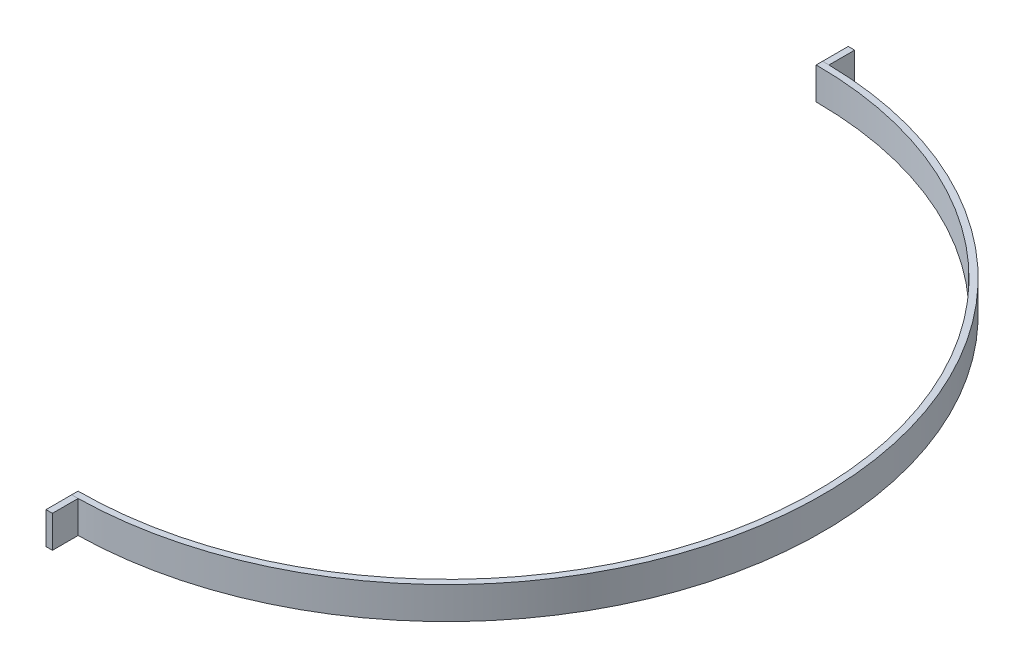
ISO-10303-21;
HEADER;
FILE_DESCRIPTION(('STEP AP214'),'2;1');
FILE_NAME('part.step','',(''),(''),'','','');
FILE_SCHEMA(('AUTOMOTIVE_DESIGN { 1 0 10303 214 1 1 1 1 }'));
ENDSEC;
DATA;
#1=APPLICATION_CONTEXT('core data for automotive mechanical design processes');
#2=APPLICATION_PROTOCOL_DEFINITION('international standard','automotive_design',2000,#1);
#3=PRODUCT_CONTEXT('',#1,'mechanical');
#4=PRODUCT('Part','Part','',(#3));
#5=PRODUCT_RELATED_PRODUCT_CATEGORY('part','',(#4));
#6=PRODUCT_DEFINITION_FORMATION('','',#4);
#7=PRODUCT_DEFINITION_CONTEXT('part definition',#1,'design');
#8=PRODUCT_DEFINITION('design','',#6,#7);
#9=PRODUCT_DEFINITION_SHAPE('','',#8);
#10=(LENGTH_UNIT() NAMED_UNIT(*) SI_UNIT(.MILLI.,.METRE.));
#11=(NAMED_UNIT(*) PLANE_ANGLE_UNIT() SI_UNIT($,.RADIAN.));
#12=(NAMED_UNIT(*) SI_UNIT($,.STERADIAN.) SOLID_ANGLE_UNIT());
#13=UNCERTAINTY_MEASURE_WITH_UNIT(LENGTH_MEASURE(1.E-05),#10,'distance_accuracy_value','');
#14=(GEOMETRIC_REPRESENTATION_CONTEXT(3) GLOBAL_UNCERTAINTY_ASSIGNED_CONTEXT((#13)) GLOBAL_UNIT_ASSIGNED_CONTEXT((#10,
#11,#12)) REPRESENTATION_CONTEXT('',''));
#15=CARTESIAN_POINT('',(0.,0.,0.));
#16=DIRECTION('',(0.,0.,1.));
#17=DIRECTION('',(1.,0.,0.));
#18=AXIS2_PLACEMENT_3D('',#15,#16,#17);
#19=CARTESIAN_POINT('',(0.,10.,0.));
#20=DIRECTION('',(0.,-1.,0.));
#21=DIRECTION('',(0.,0.,-1.));
#22=AXIS2_PLACEMENT_3D('',#19,#20,#21);
#23=CYLINDRICAL_SURFACE('',#22,117.);
#24=CARTESIAN_POINT('',(0.,0.,0.));
#25=DIRECTION('',(0.,1.,0.));
#26=DIRECTION('',(0.,0.,1.));
#27=AXIS2_PLACEMENT_3D('',#24,#25,#26);
#28=CIRCLE('',#27,117.);
#29=CARTESIAN_POINT('',(2.,0.,-116.982904733982));
#30=VERTEX_POINT('',#29);
#31=CARTESIAN_POINT('',(0.,0.,-117.));
#32=VERTEX_POINT('',#31);
#33=EDGE_CURVE('E167',#30,#32,#28,.T.);
#34=ORIENTED_EDGE('',*,*,#33,.F.);
#35=DIRECTION('',(0.,-1.,0.));
#36=VECTOR('',#35,1.);
#37=CARTESIAN_POINT('',(2.,10.,-116.982904733982));
#38=LINE('',#37,#36);
#39=CARTESIAN_POINT('',(2.,10.,-116.982904733982));
#40=VERTEX_POINT('',#39);
#41=EDGE_CURVE('E13',#40,#30,#38,.T.);
#42=ORIENTED_EDGE('',*,*,#41,.F.);
#43=CARTESIAN_POINT('',(0.,10.,0.));
#44=DIRECTION('',(0.,1.,0.));
#45=DIRECTION('',(0.,0.,1.));
#46=AXIS2_PLACEMENT_3D('',#43,#44,#45);
#47=CIRCLE('',#46,117.);
#48=CARTESIAN_POINT('',(0.,10.,-117.));
#49=VERTEX_POINT('',#48);
#50=EDGE_CURVE('E159',#40,#49,#47,.T.);
#51=ORIENTED_EDGE('',*,*,#50,.T.);
#52=DIRECTION('',(0.,-1.,0.));
#53=VECTOR('',#52,1.);
#54=CARTESIAN_POINT('',(0.,10.,-117.));
#55=LINE('',#54,#53);
#56=EDGE_CURVE('E120',#49,#32,#55,.T.);
#57=ORIENTED_EDGE('',*,*,#56,.T.);
#58=EDGE_LOOP('',(#34,#42,#51,#57));
#59=FACE_BOUND('',#58,.T.);
#60=ADVANCED_FACE('F104',(#59),#23,.F.);
#61=CARTESIAN_POINT('',(2.00000000000001,10.,0.));
#62=DIRECTION('',(1.,0.,0.));
#63=DIRECTION('',(0.,0.,-1.));
#64=AXIS2_PLACEMENT_3D('',#61,#62,#63);
#65=PLANE('',#64);
#66=DIRECTION('',(0.,0.,1.));
#67=VECTOR('',#66,1.);
#68=CARTESIAN_POINT('',(2.00000000000001,0.,0.));
#69=LINE('',#68,#67);
#70=CARTESIAN_POINT('',(2.,0.,-124.982904733982));
#71=VERTEX_POINT('',#70);
#72=EDGE_CURVE('E150',#71,#30,#69,.T.);
#73=ORIENTED_EDGE('',*,*,#72,.F.);
#74=DIRECTION('',(0.,-1.,0.));
#75=VECTOR('',#74,1.);
#76=CARTESIAN_POINT('',(2.,10.,-124.982904733982));
#77=LINE('',#76,#75);
#78=CARTESIAN_POINT('',(2.,10.,-124.982904733982));
#79=VERTEX_POINT('',#78);
#80=EDGE_CURVE('E112',#79,#71,#77,.T.);
#81=ORIENTED_EDGE('',*,*,#80,.F.);
#82=DIRECTION('',(0.,0.,1.));
#83=VECTOR('',#82,1.);
#84=CARTESIAN_POINT('',(2.00000000000001,10.,0.));
#85=LINE('',#84,#83);
#86=EDGE_CURVE('E148',#79,#40,#85,.T.);
#87=ORIENTED_EDGE('',*,*,#86,.T.);
#88=ORIENTED_EDGE('',*,*,#41,.T.);
#89=EDGE_LOOP('',(#73,#81,#87,#88));
#90=FACE_BOUND('',#89,.T.);
#91=ADVANCED_FACE('F147',(#90),#65,.T.);
#92=CARTESIAN_POINT('',(0.,10.,-124.982904733982));
#93=DIRECTION('',(0.,0.,-1.));
#94=DIRECTION('',(-1.,0.,0.));
#95=AXIS2_PLACEMENT_3D('',#92,#93,#94);
#96=PLANE('',#95);
#97=DIRECTION('',(1.,0.,0.));
#98=VECTOR('',#97,1.);
#99=CARTESIAN_POINT('',(0.,0.,-124.982904733982));
#100=LINE('',#99,#98);
#101=CARTESIAN_POINT('',(0.,0.,-124.982904733982));
#102=VERTEX_POINT('',#101);
#103=EDGE_CURVE('E170',#102,#71,#100,.T.);
#104=ORIENTED_EDGE('',*,*,#103,.F.);
#105=DIRECTION('',(0.,-1.,0.));
#106=VECTOR('',#105,1.);
#107=CARTESIAN_POINT('',(0.,10.,-124.982904733982));
#108=LINE('',#107,#106);
#109=CARTESIAN_POINT('',(0.,10.,-124.982904733982));
#110=VERTEX_POINT('',#109);
#111=EDGE_CURVE('E133',#110,#102,#108,.T.);
#112=ORIENTED_EDGE('',*,*,#111,.F.);
#113=DIRECTION('',(1.,0.,0.));
#114=VECTOR('',#113,1.);
#115=CARTESIAN_POINT('',(0.,10.,-124.982904733982));
#116=LINE('',#115,#114);
#117=EDGE_CURVE('E158',#110,#79,#116,.T.);
#118=ORIENTED_EDGE('',*,*,#117,.T.);
#119=ORIENTED_EDGE('',*,*,#80,.T.);
#120=EDGE_LOOP('',(#104,#112,#118,#119));
#121=FACE_BOUND('',#120,.T.);
#122=ADVANCED_FACE('F161',(#121),#96,.T.);
#123=CARTESIAN_POINT('',(0.,10.,0.));
#124=DIRECTION('',(-1.,0.,0.));
#125=DIRECTION('',(0.,0.,1.));
#126=AXIS2_PLACEMENT_3D('',#123,#124,#125);
#127=PLANE('',#126);
#128=DIRECTION('',(0.,0.,-1.));
#129=VECTOR('',#128,1.);
#130=CARTESIAN_POINT('',(0.,0.,0.));
#131=LINE('',#130,#129);
#132=EDGE_CURVE('E172',#32,#102,#131,.T.);
#133=ORIENTED_EDGE('',*,*,#132,.F.);
#134=ORIENTED_EDGE('',*,*,#56,.F.);
#135=DIRECTION('',(0.,0.,-1.));
#136=VECTOR('',#135,1.);
#137=CARTESIAN_POINT('',(0.,10.,0.));
#138=LINE('',#137,#136);
#139=EDGE_CURVE('E162',#49,#110,#138,.T.);
#140=ORIENTED_EDGE('',*,*,#139,.T.);
#141=ORIENTED_EDGE('',*,*,#111,.T.);
#142=EDGE_LOOP('',(#133,#134,#140,#141));
#143=FACE_BOUND('',#142,.T.);
#144=ADVANCED_FACE('F177',(#143),#127,.T.);
#145=CARTESIAN_POINT('',(0.,10.,0.));
#146=DIRECTION('',(0.,1.,0.));
#147=DIRECTION('',(0.,0.,1.));
#148=AXIS2_PLACEMENT_3D('',#145,#146,#147);
#149=PLANE('',#148);
#150=ORIENTED_EDGE('',*,*,#50,.F.);
#151=ORIENTED_EDGE('',*,*,#86,.F.);
#152=ORIENTED_EDGE('',*,*,#117,.F.);
#153=ORIENTED_EDGE('',*,*,#139,.F.);
#154=EDGE_LOOP('',(#150,#151,#152,#153));
#155=FACE_BOUND('',#154,.T.);
#156=ADVANCED_FACE('F156',(#155),#149,.T.);
#157=CARTESIAN_POINT('',(0.,0.,0.));
#158=DIRECTION('',(0.,1.,0.));
#159=DIRECTION('',(0.,0.,1.));
#160=AXIS2_PLACEMENT_3D('',#157,#158,#159);
#161=PLANE('',#160);
#162=ORIENTED_EDGE('',*,*,#33,.T.);
#163=ORIENTED_EDGE('',*,*,#132,.T.);
#164=ORIENTED_EDGE('',*,*,#103,.T.);
#165=ORIENTED_EDGE('',*,*,#72,.T.);
#166=EDGE_LOOP('',(#162,#163,#164,#165));
#167=FACE_BOUND('',#166,.T.);
#168=ADVANCED_FACE('F184',(#167),#161,.F.);
#169=CLOSED_SHELL('',(#60,#91,#122,#144,#156,#168));
#170=MANIFOLD_SOLID_BREP('B2',#169);
#171=CARTESIAN_POINT('',(0.,10.,0.));
#172=DIRECTION('',(0.,-1.,0.));
#173=DIRECTION('',(0.,0.,-1.));
#174=AXIS2_PLACEMENT_3D('',#171,#172,#173);
#175=CYLINDRICAL_SURFACE('',#174,117.);
#176=CARTESIAN_POINT('',(0.,0.,0.));
#177=DIRECTION('',(0.,1.,0.));
#178=DIRECTION('',(0.,0.,1.));
#179=AXIS2_PLACEMENT_3D('',#176,#177,#178);
#180=CIRCLE('',#179,117.);
#181=CARTESIAN_POINT('',(0.,0.,117.));
#182=VERTEX_POINT('',#181);
#183=CARTESIAN_POINT('',(2.,0.,116.982904733982));
#184=VERTEX_POINT('',#183);
#185=EDGE_CURVE('E299',#182,#184,#180,.T.);
#186=ORIENTED_EDGE('',*,*,#185,.F.);
#187=DIRECTION('',(0.,-1.,0.));
#188=VECTOR('',#187,1.);
#189=CARTESIAN_POINT('',(0.,10.,117.));
#190=LINE('',#189,#188);
#191=CARTESIAN_POINT('',(0.,10.,117.));
#192=VERTEX_POINT('',#191);
#193=EDGE_CURVE('E102',#192,#182,#190,.T.);
#194=ORIENTED_EDGE('',*,*,#193,.F.);
#195=CARTESIAN_POINT('',(0.,10.,0.));
#196=DIRECTION('',(0.,1.,0.));
#197=DIRECTION('',(0.,0.,1.));
#198=AXIS2_PLACEMENT_3D('',#195,#196,#197);
#199=CIRCLE('',#198,117.);
#200=CARTESIAN_POINT('',(2.,10.,116.982904733982));
#201=VERTEX_POINT('',#200);
#202=EDGE_CURVE('E287',#192,#201,#199,.T.);
#203=ORIENTED_EDGE('',*,*,#202,.T.);
#204=DIRECTION('',(0.,-1.,0.));
#205=VECTOR('',#204,1.);
#206=CARTESIAN_POINT('',(2.,10.,116.982904733982));
#207=LINE('',#206,#205);
#208=EDGE_CURVE('E276',#201,#184,#207,.T.);
#209=ORIENTED_EDGE('',*,*,#208,.T.);
#210=EDGE_LOOP('',(#186,#194,#203,#209));
#211=FACE_BOUND('',#210,.T.);
#212=ADVANCED_FACE('F237',(#211),#175,.F.);
#213=CARTESIAN_POINT('',(0.,10.,0.));
#214=DIRECTION('',(1.,0.,0.));
#215=DIRECTION('',(0.,0.,-1.));
#216=AXIS2_PLACEMENT_3D('',#213,#214,#215);
#217=PLANE('',#216);
#218=DIRECTION('',(0.,0.,1.));
#219=VECTOR('',#218,1.);
#220=CARTESIAN_POINT('',(0.,0.,0.));
#221=LINE('',#220,#219);
#222=CARTESIAN_POINT('',(0.,0.,124.982904733982));
#223=VERTEX_POINT('',#222);
#224=EDGE_CURVE('E292',#182,#223,#221,.T.);
#225=ORIENTED_EDGE('',*,*,#224,.T.);
#226=DIRECTION('',(0.,-1.,0.));
#227=VECTOR('',#226,1.);
#228=CARTESIAN_POINT('',(0.,10.,124.982904733982));
#229=LINE('',#228,#227);
#230=CARTESIAN_POINT('',(0.,10.,124.982904733982));
#231=VERTEX_POINT('',#230);
#232=EDGE_CURVE('E245',#231,#223,#229,.T.);
#233=ORIENTED_EDGE('',*,*,#232,.F.);
#234=DIRECTION('',(0.,0.,1.));
#235=VECTOR('',#234,1.);
#236=CARTESIAN_POINT('',(0.,10.,0.));
#237=LINE('',#236,#235);
#238=EDGE_CURVE('E282',#192,#231,#237,.T.);
#239=ORIENTED_EDGE('',*,*,#238,.F.);
#240=ORIENTED_EDGE('',*,*,#193,.T.);
#241=EDGE_LOOP('',(#225,#233,#239,#240));
#242=FACE_BOUND('',#241,.T.);
#243=ADVANCED_FACE('F290',(#242),#217,.F.);
#244=CARTESIAN_POINT('',(0.,10.,124.982904733982));
#245=DIRECTION('',(0.,0.,-1.));
#246=DIRECTION('',(-1.,0.,0.));
#247=AXIS2_PLACEMENT_3D('',#244,#245,#246);
#248=PLANE('',#247);
#249=DIRECTION('',(1.,0.,0.));
#250=VECTOR('',#249,1.);
#251=CARTESIAN_POINT('',(0.,0.,124.982904733982));
#252=LINE('',#251,#250);
#253=CARTESIAN_POINT('',(2.,0.,124.982904733982));
#254=VERTEX_POINT('',#253);
#255=EDGE_CURVE('E269',#223,#254,#252,.T.);
#256=ORIENTED_EDGE('',*,*,#255,.T.);
#257=DIRECTION('',(0.,-1.,0.));
#258=VECTOR('',#257,1.);
#259=CARTESIAN_POINT('',(2.,10.,124.982904733982));
#260=LINE('',#259,#258);
#261=CARTESIAN_POINT('',(2.,10.,124.982904733982));
#262=VERTEX_POINT('',#261);
#263=EDGE_CURVE('E293',#262,#254,#260,.T.);
#264=ORIENTED_EDGE('',*,*,#263,.F.);
#265=DIRECTION('',(1.,0.,0.));
#266=VECTOR('',#265,1.);
#267=CARTESIAN_POINT('',(0.,10.,124.982904733982));
#268=LINE('',#267,#266);
#269=EDGE_CURVE('E286',#231,#262,#268,.T.);
#270=ORIENTED_EDGE('',*,*,#269,.F.);
#271=ORIENTED_EDGE('',*,*,#232,.T.);
#272=EDGE_LOOP('',(#256,#264,#270,#271));
#273=FACE_BOUND('',#272,.T.);
#274=ADVANCED_FACE('F294',(#273),#248,.F.);
#275=CARTESIAN_POINT('',(2.00000000000001,10.,0.));
#276=DIRECTION('',(-1.,0.,0.));
#277=DIRECTION('',(0.,0.,1.));
#278=AXIS2_PLACEMENT_3D('',#275,#276,#277);
#279=PLANE('',#278);
#280=DIRECTION('',(0.,0.,-1.));
#281=VECTOR('',#280,1.);
#282=CARTESIAN_POINT('',(2.00000000000001,0.,0.));
#283=LINE('',#282,#281);
#284=EDGE_CURVE('E304',#254,#184,#283,.T.);
#285=ORIENTED_EDGE('',*,*,#284,.T.);
#286=ORIENTED_EDGE('',*,*,#208,.F.);
#287=DIRECTION('',(0.,0.,-1.));
#288=VECTOR('',#287,1.);
#289=CARTESIAN_POINT('',(2.00000000000001,10.,0.));
#290=LINE('',#289,#288);
#291=EDGE_CURVE('E253',#262,#201,#290,.T.);
#292=ORIENTED_EDGE('',*,*,#291,.F.);
#293=ORIENTED_EDGE('',*,*,#263,.T.);
#294=EDGE_LOOP('',(#285,#286,#292,#293));
#295=FACE_BOUND('',#294,.T.);
#296=ADVANCED_FACE('F309',(#295),#279,.F.);
#297=CARTESIAN_POINT('',(0.,10.,0.));
#298=DIRECTION('',(0.,1.,0.));
#299=DIRECTION('',(0.,0.,1.));
#300=AXIS2_PLACEMENT_3D('',#297,#298,#299);
#301=PLANE('',#300);
#302=ORIENTED_EDGE('',*,*,#202,.F.);
#303=ORIENTED_EDGE('',*,*,#238,.T.);
#304=ORIENTED_EDGE('',*,*,#269,.T.);
#305=ORIENTED_EDGE('',*,*,#291,.T.);
#306=EDGE_LOOP('',(#302,#303,#304,#305));
#307=FACE_BOUND('',#306,.T.);
#308=ADVANCED_FACE('F284',(#307),#301,.T.);
#309=CARTESIAN_POINT('',(0.,0.,0.));
#310=DIRECTION('',(0.,1.,0.));
#311=DIRECTION('',(0.,0.,1.));
#312=AXIS2_PLACEMENT_3D('',#309,#310,#311);
#313=PLANE('',#312);
#314=ORIENTED_EDGE('',*,*,#185,.T.);
#315=ORIENTED_EDGE('',*,*,#284,.F.);
#316=ORIENTED_EDGE('',*,*,#255,.F.);
#317=ORIENTED_EDGE('',*,*,#224,.F.);
#318=EDGE_LOOP('',(#314,#315,#316,#317));
#319=FACE_BOUND('',#318,.T.);
#320=ADVANCED_FACE('F311',(#319),#313,.F.);
#321=CLOSED_SHELL('',(#212,#243,#274,#296,#308,#320));
#322=MANIFOLD_SOLID_BREP('B7',#321);
#323=CARTESIAN_POINT('',(0.999999999999866,10.,116.991452366991));
#324=DIRECTION('',(0.00854732077220222,0.,0.999963470986624));
#325=DIRECTION('',(0.999963470986624,0.,-0.00854732077220222));
#326=AXIS2_PLACEMENT_3D('',#323,#324,#325);
#327=PLANE('',#326);
#328=DIRECTION('',(-0.999963470986624,0.,0.00854732077220222));
#329=VECTOR('',#328,1.);
#330=CARTESIAN_POINT('',(0.999999999999866,0.,116.991452366991));
#331=LINE('',#330,#329);
#332=CARTESIAN_POINT('',(2.,0.,116.982904733982));
#333=VERTEX_POINT('',#332);
#334=CARTESIAN_POINT('',(0.,0.,117.));
#335=VERTEX_POINT('',#334);
#336=EDGE_CURVE('E442',#333,#335,#331,.T.);
#337=ORIENTED_EDGE('',*,*,#336,.F.);
#338=DIRECTION('',(0.,-1.,0.));
#339=VECTOR('',#338,1.);
#340=CARTESIAN_POINT('',(2.,10.,116.982904733982));
#341=LINE('',#340,#339);
#342=CARTESIAN_POINT('',(2.,10.,116.982904733982));
#343=VERTEX_POINT('',#342);
#344=EDGE_CURVE('E235',#343,#333,#341,.T.);
#345=ORIENTED_EDGE('',*,*,#344,.F.);
#346=DIRECTION('',(-0.999963470986624,0.,0.00854732077220222));
#347=VECTOR('',#346,1.);
#348=CARTESIAN_POINT('',(0.999999999999866,10.,116.991452366991));
#349=LINE('',#348,#347);
#350=CARTESIAN_POINT('',(0.,10.,117.));
#351=VERTEX_POINT('',#350);
#352=EDGE_CURVE('E464',#343,#351,#349,.T.);
#353=ORIENTED_EDGE('',*,*,#352,.T.);
#354=DIRECTION('',(0.,-1.,0.));
#355=VECTOR('',#354,1.);
#356=CARTESIAN_POINT('',(0.,10.,117.));
#357=LINE('',#356,#355);
#358=EDGE_CURVE('E405',#351,#335,#357,.T.);
#359=ORIENTED_EDGE('',*,*,#358,.T.);
#360=EDGE_LOOP('',(#337,#345,#353,#359));
#361=FACE_BOUND('',#360,.T.);
#362=ADVANCED_FACE('F361',(#361),#327,.T.);
#363=CARTESIAN_POINT('',(0.,10.,0.));
#364=DIRECTION('',(0.,-1.,0.));
#365=DIRECTION('',(0.,0.,-1.));
#366=AXIS2_PLACEMENT_3D('',#363,#364,#365);
#367=CYLINDRICAL_SURFACE('',#366,117.);
#368=CARTESIAN_POINT('',(0.,0.,0.));
#369=DIRECTION('',(0.,1.,0.));
#370=DIRECTION('',(0.,0.,1.));
#371=AXIS2_PLACEMENT_3D('',#368,#369,#370);
#372=CIRCLE('',#371,117.);
#373=CARTESIAN_POINT('',(2.,0.,-116.982904733982));
#374=VERTEX_POINT('',#373);
#375=EDGE_CURVE('E445',#333,#374,#372,.T.);
#376=ORIENTED_EDGE('',*,*,#375,.T.);
#377=DIRECTION('',(0.,-1.,0.));
#378=VECTOR('',#377,1.);
#379=CARTESIAN_POINT('',(2.,10.,-116.982904733982));
#380=LINE('',#379,#378);
#381=CARTESIAN_POINT('',(2.,10.,-116.982904733982));
#382=VERTEX_POINT('',#381);
#383=EDGE_CURVE('E369',#382,#374,#380,.T.);
#384=ORIENTED_EDGE('',*,*,#383,.F.);
#385=CARTESIAN_POINT('',(0.,10.,0.));
#386=DIRECTION('',(0.,1.,0.));
#387=DIRECTION('',(0.,0.,1.));
#388=AXIS2_PLACEMENT_3D('',#385,#386,#387);
#389=CIRCLE('',#388,117.);
#390=EDGE_CURVE('E465',#343,#382,#389,.T.);
#391=ORIENTED_EDGE('',*,*,#390,.F.);
#392=ORIENTED_EDGE('',*,*,#344,.T.);
#393=EDGE_LOOP('',(#376,#384,#391,#392));
#394=FACE_BOUND('',#393,.T.);
#395=ADVANCED_FACE('F468',(#394),#367,.T.);
#396=CARTESIAN_POINT('',(0.999999999999866,10.,-116.991452366991));
#397=DIRECTION('',(-0.00854732077220222,0.,0.999963470986624));
#398=DIRECTION('',(0.999963470986624,0.,0.00854732077220222));
#399=AXIS2_PLACEMENT_3D('',#396,#397,#398);
#400=PLANE('',#399);
#401=DIRECTION('',(-0.999963470986624,0.,-0.00854732077220222));
#402=VECTOR('',#401,1.);
#403=CARTESIAN_POINT('',(0.999999999999866,0.,-116.991452366991));
#404=LINE('',#403,#402);
#405=CARTESIAN_POINT('',(0.,0.,-117.));
#406=VERTEX_POINT('',#405);
#407=EDGE_CURVE('E447',#374,#406,#404,.T.);
#408=ORIENTED_EDGE('',*,*,#407,.T.);
#409=DIRECTION('',(0.,-1.,0.));
#410=VECTOR('',#409,1.);
#411=CARTESIAN_POINT('',(0.,10.,-117.));
#412=LINE('',#411,#410);
#413=CARTESIAN_POINT('',(0.,10.,-117.));
#414=VERTEX_POINT('',#413);
#415=EDGE_CURVE('E436',#414,#406,#412,.T.);
#416=ORIENTED_EDGE('',*,*,#415,.F.);
#417=DIRECTION('',(-0.999963470986624,0.,-0.00854732077220222));
#418=VECTOR('',#417,1.);
#419=CARTESIAN_POINT('',(0.999999999999866,10.,-116.991452366991));
#420=LINE('',#419,#418);
#421=EDGE_CURVE('E423',#382,#414,#420,.T.);
#422=ORIENTED_EDGE('',*,*,#421,.F.);
#423=ORIENTED_EDGE('',*,*,#383,.T.);
#424=EDGE_LOOP('',(#408,#416,#422,#423));
#425=FACE_BOUND('',#424,.T.);
#426=ADVANCED_FACE('F459',(#425),#400,.F.);
#427=CARTESIAN_POINT('',(0.,10.,0.));
#428=DIRECTION('',(1.,0.,0.));
#429=DIRECTION('',(0.,0.,-1.));
#430=AXIS2_PLACEMENT_3D('',#427,#428,#429);
#431=PLANE('',#430);
#432=DIRECTION('',(0.,0.,1.));
#433=VECTOR('',#432,1.);
#434=CARTESIAN_POINT('',(0.,0.,0.));
#435=LINE('',#434,#433);
#436=CARTESIAN_POINT('',(0.,0.,-115.));
#437=VERTEX_POINT('',#436);
#438=EDGE_CURVE('E432',#406,#437,#435,.T.);
#439=ORIENTED_EDGE('',*,*,#438,.T.);
#440=DIRECTION('',(0.,-1.,0.));
#441=VECTOR('',#440,1.);
#442=CARTESIAN_POINT('',(0.,10.,-115.));
#443=LINE('',#442,#441);
#444=CARTESIAN_POINT('',(0.,10.,-115.));
#445=VERTEX_POINT('',#444);
#446=EDGE_CURVE('E429',#445,#437,#443,.T.);
#447=ORIENTED_EDGE('',*,*,#446,.F.);
#448=DIRECTION('',(0.,0.,1.));
#449=VECTOR('',#448,1.);
#450=CARTESIAN_POINT('',(0.,10.,0.));
#451=LINE('',#450,#449);
#452=EDGE_CURVE('E417',#414,#445,#451,.T.);
#453=ORIENTED_EDGE('',*,*,#452,.F.);
#454=ORIENTED_EDGE('',*,*,#415,.T.);
#455=EDGE_LOOP('',(#439,#447,#453,#454));
#456=FACE_BOUND('',#455,.T.);
#457=ADVANCED_FACE('F430',(#456),#431,.F.);
#458=CARTESIAN_POINT('',(0.,10.,0.));
#459=DIRECTION('',(0.,-1.,0.));
#460=DIRECTION('',(0.,0.,-1.));
#461=AXIS2_PLACEMENT_3D('',#458,#459,#460);
#462=CYLINDRICAL_SURFACE('',#461,115.);
#463=CARTESIAN_POINT('',(0.,0.,0.));
#464=DIRECTION('',(0.,1.,0.));
#465=DIRECTION('',(0.,0.,1.));
#466=AXIS2_PLACEMENT_3D('',#463,#464,#465);
#467=CIRCLE('',#466,115.);
#468=CARTESIAN_POINT('',(0.,0.,115.));
#469=VERTEX_POINT('',#468);
#470=EDGE_CURVE('E450',#469,#437,#467,.T.);
#471=ORIENTED_EDGE('',*,*,#470,.F.);
#472=DIRECTION('',(0.,-1.,0.));
#473=VECTOR('',#472,1.);
#474=CARTESIAN_POINT('',(0.,10.,115.));
#475=LINE('',#474,#473);
#476=CARTESIAN_POINT('',(0.,10.,115.));
#477=VERTEX_POINT('',#476);
#478=EDGE_CURVE('E398',#477,#469,#475,.T.);
#479=ORIENTED_EDGE('',*,*,#478,.F.);
#480=CARTESIAN_POINT('',(0.,10.,0.));
#481=DIRECTION('',(0.,1.,0.));
#482=DIRECTION('',(0.,0.,1.));
#483=AXIS2_PLACEMENT_3D('',#480,#481,#482);
#484=CIRCLE('',#483,115.);
#485=EDGE_CURVE('E421',#477,#445,#484,.T.);
#486=ORIENTED_EDGE('',*,*,#485,.T.);
#487=ORIENTED_EDGE('',*,*,#446,.T.);
#488=EDGE_LOOP('',(#471,#479,#486,#487));
#489=FACE_BOUND('',#488,.T.);
#490=ADVANCED_FACE('F438',(#489),#462,.F.);
#491=EDGE_CURVE('E451',#469,#335,#435,.T.);
#492=ORIENTED_EDGE('',*,*,#491,.T.);
#493=ORIENTED_EDGE('',*,*,#358,.F.);
#494=EDGE_CURVE('E377',#477,#351,#451,.T.);
#495=ORIENTED_EDGE('',*,*,#494,.F.);
#496=ORIENTED_EDGE('',*,*,#478,.T.);
#497=EDGE_LOOP('',(#492,#493,#495,#496));
#498=FACE_BOUND('',#497,.T.);
#499=ADVANCED_FACE('F478',(#498),#431,.F.);
#500=CARTESIAN_POINT('',(0.,10.,0.));
#501=DIRECTION('',(0.,1.,0.));
#502=DIRECTION('',(0.,0.,1.));
#503=AXIS2_PLACEMENT_3D('',#500,#501,#502);
#504=PLANE('',#503);
#505=ORIENTED_EDGE('',*,*,#352,.F.);
#506=ORIENTED_EDGE('',*,*,#390,.T.);
#507=ORIENTED_EDGE('',*,*,#421,.T.);
#508=ORIENTED_EDGE('',*,*,#452,.T.);
#509=ORIENTED_EDGE('',*,*,#485,.F.);
#510=ORIENTED_EDGE('',*,*,#494,.T.);
#511=EDGE_LOOP('',(#505,#506,#507,#508,#509,#510));
#512=FACE_BOUND('',#511,.T.);
#513=ADVANCED_FACE('F419',(#512),#504,.T.);
#514=CARTESIAN_POINT('',(0.,0.,0.));
#515=DIRECTION('',(0.,1.,0.));
#516=DIRECTION('',(0.,0.,1.));
#517=AXIS2_PLACEMENT_3D('',#514,#515,#516);
#518=PLANE('',#517);
#519=ORIENTED_EDGE('',*,*,#336,.T.);
#520=ORIENTED_EDGE('',*,*,#491,.F.);
#521=ORIENTED_EDGE('',*,*,#470,.T.);
#522=ORIENTED_EDGE('',*,*,#438,.F.);
#523=ORIENTED_EDGE('',*,*,#407,.F.);
#524=ORIENTED_EDGE('',*,*,#375,.F.);
#525=EDGE_LOOP('',(#519,#520,#521,#522,#523,#524));
#526=FACE_BOUND('',#525,.T.);
#527=ADVANCED_FACE('F463',(#526),#518,.F.);
#528=CLOSED_SHELL('',(#362,#395,#426,#457,#490,#499,#513,#527));
#529=MANIFOLD_SOLID_BREP('B96',#528);
#530=ADVANCED_BREP_SHAPE_REPRESENTATION('',(#18,#170,#322,#529),#14);
#531=SHAPE_DEFINITION_REPRESENTATION(#9,#530);
ENDSEC;
END-ISO-10303-21;
